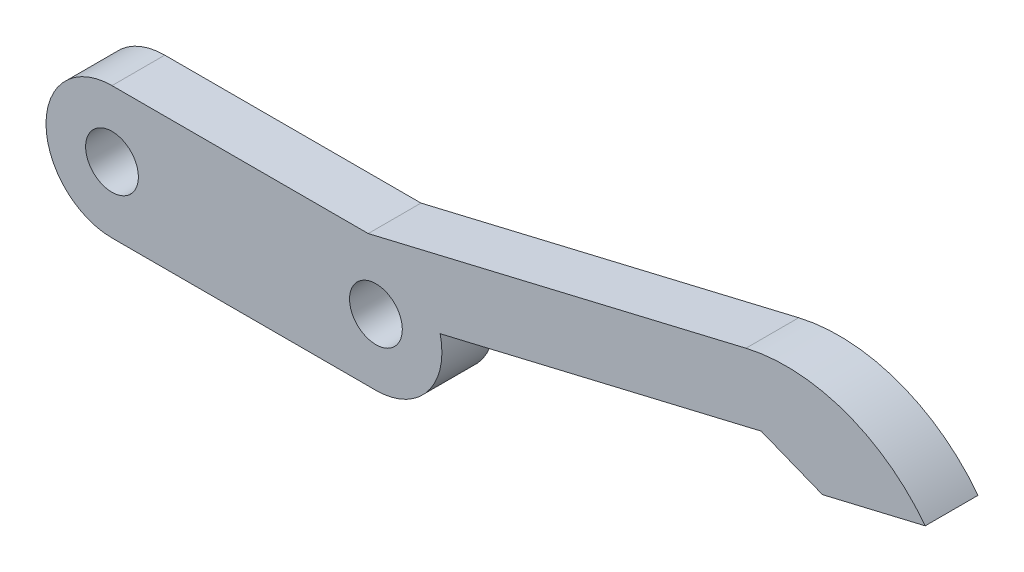
ISO-10303-21;
HEADER;
FILE_DESCRIPTION(('STEP AP214'),'2;1');
FILE_NAME('part.step','',(''),(''),'','','');
FILE_SCHEMA(('AUTOMOTIVE_DESIGN { 1 0 10303 214 1 1 1 1 }'));
ENDSEC;
DATA;
#1=APPLICATION_CONTEXT('core data for automotive mechanical design processes');
#2=APPLICATION_PROTOCOL_DEFINITION('international standard','automotive_design',2000,#1);
#3=PRODUCT_CONTEXT('',#1,'mechanical');
#4=PRODUCT('Part','Part','',(#3));
#5=PRODUCT_RELATED_PRODUCT_CATEGORY('part','',(#4));
#6=PRODUCT_DEFINITION_FORMATION('','',#4);
#7=PRODUCT_DEFINITION_CONTEXT('part definition',#1,'design');
#8=PRODUCT_DEFINITION('design','',#6,#7);
#9=PRODUCT_DEFINITION_SHAPE('','',#8);
#10=(LENGTH_UNIT() NAMED_UNIT(*) SI_UNIT(.MILLI.,.METRE.));
#11=(NAMED_UNIT(*) PLANE_ANGLE_UNIT() SI_UNIT($,.RADIAN.));
#12=(NAMED_UNIT(*) SI_UNIT($,.STERADIAN.) SOLID_ANGLE_UNIT());
#13=UNCERTAINTY_MEASURE_WITH_UNIT(LENGTH_MEASURE(1.E-05),#10,'distance_accuracy_value','');
#14=(GEOMETRIC_REPRESENTATION_CONTEXT(3) GLOBAL_UNCERTAINTY_ASSIGNED_CONTEXT((#13)) GLOBAL_UNIT_ASSIGNED_CONTEXT((#10,
#11,#12)) REPRESENTATION_CONTEXT('',''));
#15=CARTESIAN_POINT('',(0.,0.,0.));
#16=DIRECTION('',(0.,0.,1.));
#17=DIRECTION('',(1.,0.,0.));
#18=AXIS2_PLACEMENT_3D('',#15,#16,#17);
#19=CARTESIAN_POINT('',(10.,0.,4.));
#20=DIRECTION('',(0.,0.,-1.));
#21=DIRECTION('',(-1.,0.,0.));
#22=AXIS2_PLACEMENT_3D('',#19,#20,#21);
#23=CYLINDRICAL_SURFACE('',#22,5.);
#24=CARTESIAN_POINT('',(10.,0.,0.));
#25=DIRECTION('',(0.,0.,1.));
#26=DIRECTION('',(1.,0.,0.));
#27=AXIS2_PLACEMENT_3D('',#24,#25,#26);
#28=CIRCLE('',#27,5.);
#29=CARTESIAN_POINT('',(10.,-5.,0.));
#30=VERTEX_POINT('',#29);
#31=CARTESIAN_POINT('',(14.8651269566541,1.15349022346861,0.));
#32=VERTEX_POINT('',#31);
#33=EDGE_CURVE('E171',#30,#32,#28,.T.);
#34=ORIENTED_EDGE('',*,*,#33,.T.);
#35=DIRECTION('',(0.,0.,-1.));
#36=VECTOR('',#35,1.);
#37=CARTESIAN_POINT('',(14.8651269566541,1.15349022346861,4.));
#38=LINE('',#37,#36);
#39=CARTESIAN_POINT('',(14.8651269566541,1.15349022346861,4.));
#40=VERTEX_POINT('',#39);
#41=EDGE_CURVE('E158',#32,#40,#38,.F.);
#42=ORIENTED_EDGE('',*,*,#41,.T.);
#43=CARTESIAN_POINT('',(10.,0.,4.));
#44=DIRECTION('',(0.,0.,1.));
#45=DIRECTION('',(1.,0.,0.));
#46=AXIS2_PLACEMENT_3D('',#43,#44,#45);
#47=CIRCLE('',#46,5.);
#48=CARTESIAN_POINT('',(10.,-5.,4.));
#49=VERTEX_POINT('',#48);
#50=EDGE_CURVE('E180',#49,#40,#47,.T.);
#51=ORIENTED_EDGE('',*,*,#50,.F.);
#52=DIRECTION('',(0.,0.,-1.));
#53=VECTOR('',#52,1.);
#54=CARTESIAN_POINT('',(10.,-5.,4.));
#55=LINE('',#54,#53);
#56=EDGE_CURVE('E186',#49,#30,#55,.T.);
#57=ORIENTED_EDGE('',*,*,#56,.T.);
#58=EDGE_LOOP('',(#34,#42,#51,#57));
#59=FACE_BOUND('',#58,.T.);
#60=ADVANCED_FACE('F36',(#59),#23,.T.);
#61=CARTESIAN_POINT('',(-10.,5.,4.));
#62=DIRECTION('',(0.,-1.,0.));
#63=DIRECTION('',(0.,0.,-1.));
#64=AXIS2_PLACEMENT_3D('',#61,#62,#63);
#65=PLANE('',#64);
#66=DIRECTION('',(-1.,0.,0.));
#67=VECTOR('',#66,1.);
#68=CARTESIAN_POINT('',(-10.,5.,4.));
#69=LINE('',#68,#67);
#70=CARTESIAN_POINT('',(9.4153698028738,4.99999999999999,4.));
#71=VERTEX_POINT('',#70);
#72=CARTESIAN_POINT('',(-10.,5.,4.));
#73=VERTEX_POINT('',#72);
#74=EDGE_CURVE('E78',#71,#73,#69,.T.);
#75=ORIENTED_EDGE('',*,*,#74,.F.);
#76=DIRECTION('',(0.,0.,-1.));
#77=VECTOR('',#76,1.);
#78=CARTESIAN_POINT('',(9.41536980287386,5.,4.));
#79=LINE('',#78,#77);
#80=CARTESIAN_POINT('',(9.41536980287385,5.,0.));
#81=VERTEX_POINT('',#80);
#82=EDGE_CURVE('E164',#71,#81,#79,.T.);
#83=ORIENTED_EDGE('',*,*,#82,.T.);
#84=DIRECTION('',(-1.,0.,0.));
#85=VECTOR('',#84,1.);
#86=CARTESIAN_POINT('',(-10.,5.,0.));
#87=LINE('',#86,#85);
#88=CARTESIAN_POINT('',(-10.,5.,0.));
#89=VERTEX_POINT('',#88);
#90=EDGE_CURVE('E189',#81,#89,#87,.T.);
#91=ORIENTED_EDGE('',*,*,#90,.T.);
#92=DIRECTION('',(0.,0.,-1.));
#93=VECTOR('',#92,1.);
#94=CARTESIAN_POINT('',(-10.,5.,4.));
#95=LINE('',#94,#93);
#96=EDGE_CURVE('E11',#73,#89,#95,.T.);
#97=ORIENTED_EDGE('',*,*,#96,.F.);
#98=EDGE_LOOP('',(#75,#83,#91,#97));
#99=FACE_BOUND('',#98,.T.);
#100=ADVANCED_FACE('F220',(#99),#65,.F.);
#101=CARTESIAN_POINT('',(-10.,0.,4.));
#102=DIRECTION('',(0.,0.,-1.));
#103=DIRECTION('',(-1.,0.,0.));
#104=AXIS2_PLACEMENT_3D('',#101,#102,#103);
#105=CYLINDRICAL_SURFACE('',#104,5.);
#106=CARTESIAN_POINT('',(-10.,0.,0.));
#107=DIRECTION('',(0.,0.,1.));
#108=DIRECTION('',(1.,0.,0.));
#109=AXIS2_PLACEMENT_3D('',#106,#107,#108);
#110=CIRCLE('',#109,5.);
#111=CARTESIAN_POINT('',(-10.,-5.,0.));
#112=VERTEX_POINT('',#111);
#113=EDGE_CURVE('E191',#89,#112,#110,.T.);
#114=ORIENTED_EDGE('',*,*,#113,.T.);
#115=DIRECTION('',(0.,0.,-1.));
#116=VECTOR('',#115,1.);
#117=CARTESIAN_POINT('',(-10.,-5.,4.));
#118=LINE('',#117,#116);
#119=CARTESIAN_POINT('',(-10.,-5.,4.));
#120=VERTEX_POINT('',#119);
#121=EDGE_CURVE('E43',#120,#112,#118,.T.);
#122=ORIENTED_EDGE('',*,*,#121,.F.);
#123=CARTESIAN_POINT('',(-10.,0.,4.));
#124=DIRECTION('',(0.,0.,1.));
#125=DIRECTION('',(1.,0.,0.));
#126=AXIS2_PLACEMENT_3D('',#123,#124,#125);
#127=CIRCLE('',#126,5.);
#128=EDGE_CURVE('E183',#73,#120,#127,.T.);
#129=ORIENTED_EDGE('',*,*,#128,.F.);
#130=ORIENTED_EDGE('',*,*,#96,.T.);
#131=EDGE_LOOP('',(#114,#122,#129,#130));
#132=FACE_BOUND('',#131,.T.);
#133=ADVANCED_FACE('F224',(#132),#105,.T.);
#134=CARTESIAN_POINT('',(-10.,-5.,4.));
#135=DIRECTION('',(0.,1.,0.));
#136=DIRECTION('',(0.,0.,1.));
#137=AXIS2_PLACEMENT_3D('',#134,#135,#136);
#138=PLANE('',#137);
#139=DIRECTION('',(1.,0.,0.));
#140=VECTOR('',#139,1.);
#141=CARTESIAN_POINT('',(-10.,-5.,0.));
#142=LINE('',#141,#140);
#143=EDGE_CURVE('E75',#112,#30,#142,.T.);
#144=ORIENTED_EDGE('',*,*,#143,.T.);
#145=ORIENTED_EDGE('',*,*,#56,.F.);
#146=DIRECTION('',(1.,0.,0.));
#147=VECTOR('',#146,1.);
#148=CARTESIAN_POINT('',(-10.,-5.,4.));
#149=LINE('',#148,#147);
#150=EDGE_CURVE('E58',#120,#49,#149,.T.);
#151=ORIENTED_EDGE('',*,*,#150,.F.);
#152=ORIENTED_EDGE('',*,*,#121,.T.);
#153=EDGE_LOOP('',(#144,#145,#151,#152));
#154=FACE_BOUND('',#153,.T.);
#155=ADVANCED_FACE('F195',(#154),#138,.F.);
#156=CARTESIAN_POINT('',(10.,0.,4.));
#157=DIRECTION('',(0.,0.,1.));
#158=DIRECTION('',(1.,0.,0.));
#159=AXIS2_PLACEMENT_3D('',#156,#157,#158);
#160=PLANE('',#159);
#161=ORIENTED_EDGE('',*,*,#50,.T.);
#162=DIRECTION('',(0.973025391330819,0.230698044693722,0.));
#163=VECTOR('',#162,1.);
#164=CARTESIAN_POINT('',(11.9460507826616,0.461396089387444,4.));
#165=LINE('',#164,#163);
#166=CARTESIAN_POINT('',(39.1907617399246,6.92094134081165,4.));
#167=VERTEX_POINT('',#166);
#168=EDGE_CURVE('E143',#40,#167,#165,.T.);
#169=ORIENTED_EDGE('',*,*,#168,.T.);
#170=DIRECTION('',(0.929378700802316,-0.369127661514279,0.));
#171=VECTOR('',#170,1.);
#172=CARTESIAN_POINT('',(39.1907617399246,6.92094134081165,4.));
#173=LINE('',#172,#171);
#174=CARTESIAN_POINT('',(43.8376552439362,5.07530303324026,4.));
#175=VERTEX_POINT('',#174);
#176=EDGE_CURVE('E151',#167,#175,#173,.T.);
#177=ORIENTED_EDGE('',*,*,#176,.T.);
#178=DIRECTION('',(0.973025391330819,0.230698044693722,0.));
#179=VECTOR('',#178,1.);
#180=CARTESIAN_POINT('',(43.8376552439362,5.07530303324026,4.));
#181=LINE('',#180,#179);
#182=CARTESIAN_POINT('',(51.6218583745827,6.92088739079003,4.));
#183=VERTEX_POINT('',#182);
#184=EDGE_CURVE('E120',#175,#183,#181,.T.);
#185=ORIENTED_EDGE('',*,*,#184,.T.);
#186=CARTESIAN_POINT('',(41.0897998904729,-1.08871622712575,4.));
#187=DIRECTION('',(0.,0.,1.));
#188=DIRECTION('',(-1.,0.,0.));
#189=AXIS2_PLACEMENT_3D('',#186,#187,#188);
#190=CIRCLE('',#189,13.2317045775984);
#191=CARTESIAN_POINT('',(38.037271516456,11.7860682974657,4.));
#192=VERTEX_POINT('',#191);
#193=EDGE_CURVE('E154',#183,#192,#190,.T.);
#194=ORIENTED_EDGE('',*,*,#193,.T.);
#195=DIRECTION('',(-0.973025391330819,-0.230698044693722,0.));
#196=VECTOR('',#195,1.);
#197=CARTESIAN_POINT('',(8.84650977653139,4.8651269566541,4.));
#198=LINE('',#197,#196);
#199=EDGE_CURVE('E50',#192,#71,#198,.T.);
#200=ORIENTED_EDGE('',*,*,#199,.T.);
#201=ORIENTED_EDGE('',*,*,#74,.T.);
#202=ORIENTED_EDGE('',*,*,#128,.T.);
#203=ORIENTED_EDGE('',*,*,#150,.T.);
#204=EDGE_LOOP('',(#161,#169,#177,#185,#194,#200,#201,#202,#203));
#205=FACE_BOUND('',#204,.T.);
#206=CARTESIAN_POINT('',(10.,0.,4.));
#207=DIRECTION('',(0.,0.,1.));
#208=DIRECTION('',(1.,0.,0.));
#209=AXIS2_PLACEMENT_3D('',#206,#207,#208);
#210=CIRCLE('',#209,2.);
#211=CARTESIAN_POINT('',(12.,0.,4.));
#212=VERTEX_POINT('',#211);
#213=EDGE_CURVE('E167',#212,#212,#210,.T.);
#214=ORIENTED_EDGE('',*,*,#213,.F.);
#215=EDGE_LOOP('',(#214));
#216=FACE_BOUND('',#215,.T.);
#217=CARTESIAN_POINT('',(-10.,0.,4.));
#218=DIRECTION('',(0.,0.,1.));
#219=DIRECTION('',(1.,0.,0.));
#220=AXIS2_PLACEMENT_3D('',#217,#218,#219);
#221=CIRCLE('',#220,2.);
#222=CARTESIAN_POINT('',(-8.,0.,4.));
#223=VERTEX_POINT('',#222);
#224=EDGE_CURVE('E172',#223,#223,#221,.T.);
#225=ORIENTED_EDGE('',*,*,#224,.F.);
#226=EDGE_LOOP('',(#225));
#227=FACE_BOUND('',#226,.T.);
#228=ADVANCED_FACE('F203',(#205,#216,#227),#160,.T.);
#229=CARTESIAN_POINT('',(10.,0.,0.));
#230=DIRECTION('',(0.,0.,1.));
#231=DIRECTION('',(1.,0.,0.));
#232=AXIS2_PLACEMENT_3D('',#229,#230,#231);
#233=PLANE('',#232);
#234=DIRECTION('',(0.973025391330819,0.230698044693722,0.));
#235=VECTOR('',#234,1.);
#236=CARTESIAN_POINT('',(11.9460507826616,0.461396089387444,0.));
#237=LINE('',#236,#235);
#238=CARTESIAN_POINT('',(39.1907617399246,6.92094134081165,0.));
#239=VERTEX_POINT('',#238);
#240=EDGE_CURVE('E126',#32,#239,#237,.T.);
#241=ORIENTED_EDGE('',*,*,#240,.F.);
#242=ORIENTED_EDGE('',*,*,#33,.F.);
#243=ORIENTED_EDGE('',*,*,#143,.F.);
#244=ORIENTED_EDGE('',*,*,#113,.F.);
#245=ORIENTED_EDGE('',*,*,#90,.F.);
#246=DIRECTION('',(-0.973025391330819,-0.230698044693722,0.));
#247=VECTOR('',#246,1.);
#248=CARTESIAN_POINT('',(8.84650977653139,4.8651269566541,0.));
#249=LINE('',#248,#247);
#250=CARTESIAN_POINT('',(38.037271516456,11.7860682974657,0.));
#251=VERTEX_POINT('',#250);
#252=EDGE_CURVE('E148',#251,#81,#249,.T.);
#253=ORIENTED_EDGE('',*,*,#252,.F.);
#254=CARTESIAN_POINT('',(41.0897998904729,-1.08871622712575,0.));
#255=DIRECTION('',(0.,0.,1.));
#256=DIRECTION('',(-1.,0.,0.));
#257=AXIS2_PLACEMENT_3D('',#254,#255,#256);
#258=CIRCLE('',#257,13.2317045775984);
#259=CARTESIAN_POINT('',(51.6218583745827,6.92088739079003,0.));
#260=VERTEX_POINT('',#259);
#261=EDGE_CURVE('E137',#260,#251,#258,.T.);
#262=ORIENTED_EDGE('',*,*,#261,.F.);
#263=DIRECTION('',(0.973025391330819,0.230698044693722,0.));
#264=VECTOR('',#263,1.);
#265=CARTESIAN_POINT('',(43.8376552439362,5.07530303324026,0.));
#266=LINE('',#265,#264);
#267=CARTESIAN_POINT('',(43.8376552439362,5.07530303324026,0.));
#268=VERTEX_POINT('',#267);
#269=EDGE_CURVE('E118',#268,#260,#266,.T.);
#270=ORIENTED_EDGE('',*,*,#269,.F.);
#271=DIRECTION('',(0.929378700802316,-0.369127661514279,0.));
#272=VECTOR('',#271,1.);
#273=CARTESIAN_POINT('',(39.1907617399246,6.92094134081165,0.));
#274=LINE('',#273,#272);
#275=EDGE_CURVE('E134',#239,#268,#274,.T.);
#276=ORIENTED_EDGE('',*,*,#275,.F.);
#277=EDGE_LOOP('',(#241,#242,#243,#244,#245,#253,#262,#270,#276));
#278=FACE_BOUND('',#277,.T.);
#279=CARTESIAN_POINT('',(10.,0.,0.));
#280=DIRECTION('',(0.,0.,1.));
#281=DIRECTION('',(1.,0.,0.));
#282=AXIS2_PLACEMENT_3D('',#279,#280,#281);
#283=CIRCLE('',#282,2.);
#284=CARTESIAN_POINT('',(12.,0.,0.));
#285=VERTEX_POINT('',#284);
#286=EDGE_CURVE('E175',#285,#285,#283,.T.);
#287=ORIENTED_EDGE('',*,*,#286,.T.);
#288=EDGE_LOOP('',(#287));
#289=FACE_BOUND('',#288,.T.);
#290=CARTESIAN_POINT('',(-10.,0.,0.));
#291=DIRECTION('',(0.,0.,1.));
#292=DIRECTION('',(1.,0.,0.));
#293=AXIS2_PLACEMENT_3D('',#290,#291,#292);
#294=CIRCLE('',#293,2.);
#295=CARTESIAN_POINT('',(-8.,0.,0.));
#296=VERTEX_POINT('',#295);
#297=EDGE_CURVE('E168',#296,#296,#294,.T.);
#298=ORIENTED_EDGE('',*,*,#297,.T.);
#299=EDGE_LOOP('',(#298));
#300=FACE_BOUND('',#299,.T.);
#301=ADVANCED_FACE('F132',(#278,#289,#300),#233,.F.);
#302=CARTESIAN_POINT('',(10.,0.,0.));
#303=DIRECTION('',(0.,0.,1.));
#304=DIRECTION('',(1.,0.,0.));
#305=AXIS2_PLACEMENT_3D('',#302,#303,#304);
#306=CYLINDRICAL_SURFACE('',#305,2.);
#307=ORIENTED_EDGE('',*,*,#286,.F.);
#308=EDGE_LOOP('',(#307));
#309=FACE_BOUND('',#308,.T.);
#310=ORIENTED_EDGE('',*,*,#213,.T.);
#311=EDGE_LOOP('',(#310));
#312=FACE_BOUND('',#311,.T.);
#313=ADVANCED_FACE('F235',(#309,#312),#306,.F.);
#314=CARTESIAN_POINT('',(-10.,0.,0.));
#315=DIRECTION('',(0.,0.,1.));
#316=DIRECTION('',(1.,0.,0.));
#317=AXIS2_PLACEMENT_3D('',#314,#315,#316);
#318=CYLINDRICAL_SURFACE('',#317,2.);
#319=ORIENTED_EDGE('',*,*,#297,.F.);
#320=EDGE_LOOP('',(#319));
#321=FACE_BOUND('',#320,.T.);
#322=ORIENTED_EDGE('',*,*,#224,.T.);
#323=EDGE_LOOP('',(#322));
#324=FACE_BOUND('',#323,.T.);
#325=ADVANCED_FACE('F216',(#321,#324),#318,.F.);
#326=CARTESIAN_POINT('',(8.84650977653139,4.8651269566541,0.));
#327=DIRECTION('',(-0.230698044693722,0.973025391330819,0.));
#328=DIRECTION('',(-0.973025391330819,-0.230698044693722,0.));
#329=AXIS2_PLACEMENT_3D('',#326,#327,#328);
#330=PLANE('',#329);
#331=ORIENTED_EDGE('',*,*,#82,.F.);
#332=ORIENTED_EDGE('',*,*,#199,.F.);
#333=DIRECTION('',(0.,0.,1.));
#334=VECTOR('',#333,1.);
#335=CARTESIAN_POINT('',(38.037271516456,11.7860682974657,0.));
#336=LINE('',#335,#334);
#337=EDGE_CURVE('E159',#251,#192,#336,.T.);
#338=ORIENTED_EDGE('',*,*,#337,.F.);
#339=ORIENTED_EDGE('',*,*,#252,.T.);
#340=EDGE_LOOP('',(#331,#332,#338,#339));
#341=FACE_BOUND('',#340,.T.);
#342=ADVANCED_FACE('F208',(#341),#330,.T.);
#343=CARTESIAN_POINT('',(11.9460507826616,0.461396089387444,0.));
#344=DIRECTION('',(0.230698044693722,-0.973025391330819,0.));
#345=DIRECTION('',(0.973025391330819,0.230698044693722,0.));
#346=AXIS2_PLACEMENT_3D('',#343,#344,#345);
#347=PLANE('',#346);
#348=ORIENTED_EDGE('',*,*,#41,.F.);
#349=ORIENTED_EDGE('',*,*,#240,.T.);
#350=DIRECTION('',(0.,0.,1.));
#351=VECTOR('',#350,1.);
#352=CARTESIAN_POINT('',(39.1907617399246,6.92094134081165,0.));
#353=LINE('',#352,#351);
#354=EDGE_CURVE('E142',#239,#167,#353,.T.);
#355=ORIENTED_EDGE('',*,*,#354,.T.);
#356=ORIENTED_EDGE('',*,*,#168,.F.);
#357=EDGE_LOOP('',(#348,#349,#355,#356));
#358=FACE_BOUND('',#357,.T.);
#359=ADVANCED_FACE('F206',(#358),#347,.T.);
#360=CARTESIAN_POINT('',(39.1907617399246,6.92094134081165,0.));
#361=DIRECTION('',(-0.369127661514279,-0.929378700802316,0.));
#362=DIRECTION('',(0.929378700802316,-0.369127661514279,0.));
#363=AXIS2_PLACEMENT_3D('',#360,#361,#362);
#364=PLANE('',#363);
#365=ORIENTED_EDGE('',*,*,#176,.F.);
#366=ORIENTED_EDGE('',*,*,#354,.F.);
#367=ORIENTED_EDGE('',*,*,#275,.T.);
#368=DIRECTION('',(0.,0.,1.));
#369=VECTOR('',#368,1.);
#370=CARTESIAN_POINT('',(43.8376552439362,5.07530303324026,0.));
#371=LINE('',#370,#369);
#372=EDGE_CURVE('E115',#268,#175,#371,.T.);
#373=ORIENTED_EDGE('',*,*,#372,.T.);
#374=EDGE_LOOP('',(#365,#366,#367,#373));
#375=FACE_BOUND('',#374,.T.);
#376=ADVANCED_FACE('F140',(#375),#364,.T.);
#377=CARTESIAN_POINT('',(41.0897998904729,-1.08871622712575,0.));
#378=DIRECTION('',(0.,0.,1.));
#379=DIRECTION('',(1.,0.,0.));
#380=AXIS2_PLACEMENT_3D('',#377,#378,#379);
#381=CYLINDRICAL_SURFACE('',#380,13.2317045775984);
#382=ORIENTED_EDGE('',*,*,#193,.F.);
#383=DIRECTION('',(0.,0.,1.));
#384=VECTOR('',#383,1.);
#385=CARTESIAN_POINT('',(51.6218583745827,6.92088739079003,0.));
#386=LINE('',#385,#384);
#387=EDGE_CURVE('E125',#260,#183,#386,.T.);
#388=ORIENTED_EDGE('',*,*,#387,.F.);
#389=ORIENTED_EDGE('',*,*,#261,.T.);
#390=ORIENTED_EDGE('',*,*,#337,.T.);
#391=EDGE_LOOP('',(#382,#388,#389,#390));
#392=FACE_BOUND('',#391,.T.);
#393=ADVANCED_FACE('F214',(#392),#381,.T.);
#394=CARTESIAN_POINT('',(43.8376552439362,5.07530303324026,0.));
#395=DIRECTION('',(0.230698044693722,-0.973025391330819,0.));
#396=DIRECTION('',(0.973025391330819,0.230698044693722,0.));
#397=AXIS2_PLACEMENT_3D('',#394,#395,#396);
#398=PLANE('',#397);
#399=ORIENTED_EDGE('',*,*,#184,.F.);
#400=ORIENTED_EDGE('',*,*,#372,.F.);
#401=ORIENTED_EDGE('',*,*,#269,.T.);
#402=ORIENTED_EDGE('',*,*,#387,.T.);
#403=EDGE_LOOP('',(#399,#400,#401,#402));
#404=FACE_BOUND('',#403,.T.);
#405=ADVANCED_FACE('F117',(#404),#398,.T.);
#406=CLOSED_SHELL('',(#60,#100,#133,#155,#228,#301,#313,#325,#342,#359,#376,#393,#405));
#407=MANIFOLD_SOLID_BREP('B2',#406);
#408=ADVANCED_BREP_SHAPE_REPRESENTATION('',(#18,#407),#14);
#409=SHAPE_DEFINITION_REPRESENTATION(#9,#408);
ENDSEC;
END-ISO-10303-21;
